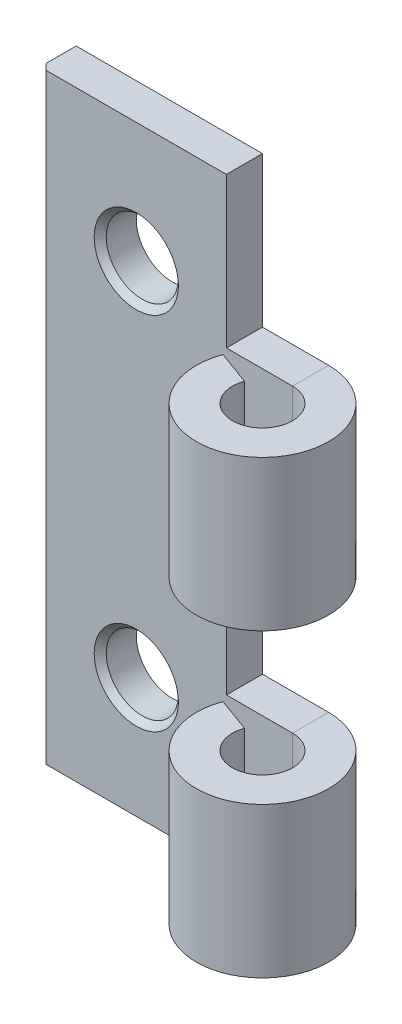
ISO-10303-21;
HEADER;
FILE_DESCRIPTION(('STEP AP214'),'2;1');
FILE_NAME('part.step','',(''),(''),'','','');
FILE_SCHEMA(('AUTOMOTIVE_DESIGN { 1 0 10303 214 1 1 1 1 }'));
ENDSEC;
DATA;
#1=APPLICATION_CONTEXT('core data for automotive mechanical design processes');
#2=APPLICATION_PROTOCOL_DEFINITION('international standard','automotive_design',2000,#1);
#3=PRODUCT_CONTEXT('',#1,'mechanical');
#4=PRODUCT('Part','Part','',(#3));
#5=PRODUCT_RELATED_PRODUCT_CATEGORY('part','',(#4));
#6=PRODUCT_DEFINITION_FORMATION('','',#4);
#7=PRODUCT_DEFINITION_CONTEXT('part definition',#1,'design');
#8=PRODUCT_DEFINITION('design','',#6,#7);
#9=PRODUCT_DEFINITION_SHAPE('','',#8);
#10=(LENGTH_UNIT() NAMED_UNIT(*) SI_UNIT(.MILLI.,.METRE.));
#11=(NAMED_UNIT(*) PLANE_ANGLE_UNIT() SI_UNIT($,.RADIAN.));
#12=(NAMED_UNIT(*) SI_UNIT($,.STERADIAN.) SOLID_ANGLE_UNIT());
#13=UNCERTAINTY_MEASURE_WITH_UNIT(LENGTH_MEASURE(1.E-05),#10,'distance_accuracy_value','');
#14=(GEOMETRIC_REPRESENTATION_CONTEXT(3) GLOBAL_UNCERTAINTY_ASSIGNED_CONTEXT((#13)) GLOBAL_UNIT_ASSIGNED_CONTEXT((#10,
#11,#12)) REPRESENTATION_CONTEXT('',''));
#15=CARTESIAN_POINT('',(0.,0.,0.));
#16=DIRECTION('',(0.,0.,1.));
#17=DIRECTION('',(1.,0.,0.));
#18=AXIS2_PLACEMENT_3D('',#15,#16,#17);
#19=CARTESIAN_POINT('',(-10.5,25.,3.));
#20=DIRECTION('',(0.,-1.,0.));
#21=DIRECTION('',(0.,0.,-1.));
#22=AXIS2_PLACEMENT_3D('',#19,#20,#21);
#23=PLANE('',#22);
#24=DIRECTION('',(0.,0.,-1.));
#25=VECTOR('',#24,1.);
#26=CARTESIAN_POINT('',(-10.5,25.,3.));
#27=LINE('',#26,#25);
#28=CARTESIAN_POINT('',(-10.5,25.,2.49999999999999));
#29=VERTEX_POINT('',#28);
#30=CARTESIAN_POINT('',(-10.5,25.,0.));
#31=VERTEX_POINT('',#30);
#32=EDGE_CURVE('E278',#29,#31,#27,.T.);
#33=ORIENTED_EDGE('',*,*,#32,.F.);
#34=DIRECTION('',(-0.707106781186548,0.,-0.707106781186548));
#35=VECTOR('',#34,1.);
#36=CARTESIAN_POINT('',(-9.99999999999999,25.,3.));
#37=LINE('',#36,#35);
#38=CARTESIAN_POINT('',(-9.99999999999999,25.,3.));
#39=VERTEX_POINT('',#38);
#40=EDGE_CURVE('E294',#29,#39,#37,.F.);
#41=ORIENTED_EDGE('',*,*,#40,.T.);
#42=DIRECTION('',(-1.,0.,0.));
#43=VECTOR('',#42,1.);
#44=CARTESIAN_POINT('',(-10.5,25.,3.));
#45=LINE('',#44,#43);
#46=CARTESIAN_POINT('',(5.,25.,3.));
#47=VERTEX_POINT('',#46);
#48=EDGE_CURVE('E260',#47,#39,#45,.T.);
#49=ORIENTED_EDGE('',*,*,#48,.F.);
#50=DIRECTION('',(0.,0.,1.));
#51=VECTOR('',#50,1.);
#52=CARTESIAN_POINT('',(5.,25.,0.));
#53=LINE('',#52,#51);
#54=CARTESIAN_POINT('',(5.,25.,0.));
#55=VERTEX_POINT('',#54);
#56=EDGE_CURVE('E157',#55,#47,#53,.T.);
#57=ORIENTED_EDGE('',*,*,#56,.F.);
#58=DIRECTION('',(-1.,0.,0.));
#59=VECTOR('',#58,1.);
#60=CARTESIAN_POINT('',(-10.5,25.,0.));
#61=LINE('',#60,#59);
#62=EDGE_CURVE('E172',#55,#31,#61,.T.);
#63=ORIENTED_EDGE('',*,*,#62,.T.);
#64=EDGE_LOOP('',(#33,#41,#49,#57,#63));
#65=FACE_BOUND('',#64,.T.);
#66=ADVANCED_FACE('F40',(#65),#23,.F.);
#67=CARTESIAN_POINT('',(-10.5,-25.,3.));
#68=DIRECTION('',(1.,0.,0.));
#69=DIRECTION('',(0.,0.,-1.));
#70=AXIS2_PLACEMENT_3D('',#67,#68,#69);
#71=PLANE('',#70);
#72=DIRECTION('',(0.,0.,-1.));
#73=VECTOR('',#72,1.);
#74=CARTESIAN_POINT('',(-10.5,-25.,3.));
#75=LINE('',#74,#73);
#76=CARTESIAN_POINT('',(-10.5,-25.,2.49999999999999));
#77=VERTEX_POINT('',#76);
#78=CARTESIAN_POINT('',(-10.5,-25.,0.));
#79=VERTEX_POINT('',#78);
#80=EDGE_CURVE('E276',#77,#79,#75,.T.);
#81=ORIENTED_EDGE('',*,*,#80,.F.);
#82=DIRECTION('',(0.,1.,0.));
#83=VECTOR('',#82,1.);
#84=CARTESIAN_POINT('',(-10.5,-25.,2.49999999999999));
#85=LINE('',#84,#83);
#86=EDGE_CURVE('E56',#77,#29,#85,.T.);
#87=ORIENTED_EDGE('',*,*,#86,.T.);
#88=ORIENTED_EDGE('',*,*,#32,.T.);
#89=DIRECTION('',(0.,-1.,0.));
#90=VECTOR('',#89,1.);
#91=CARTESIAN_POINT('',(-10.5,-25.,0.));
#92=LINE('',#91,#90);
#93=EDGE_CURVE('E270',#31,#79,#92,.T.);
#94=ORIENTED_EDGE('',*,*,#93,.T.);
#95=EDGE_LOOP('',(#81,#87,#88,#94));
#96=FACE_BOUND('',#95,.T.);
#97=ADVANCED_FACE('F316',(#96),#71,.F.);
#98=CARTESIAN_POINT('',(-10.5,-25.,3.));
#99=DIRECTION('',(0.,1.,0.));
#100=DIRECTION('',(0.,0.,1.));
#101=AXIS2_PLACEMENT_3D('',#98,#99,#100);
#102=PLANE('',#101);
#103=DIRECTION('',(1.,0.,0.));
#104=VECTOR('',#103,1.);
#105=CARTESIAN_POINT('',(-10.5,-25.,3.));
#106=LINE('',#105,#104);
#107=CARTESIAN_POINT('',(-9.99999999999999,-25.,3.));
#108=VERTEX_POINT('',#107);
#109=CARTESIAN_POINT('',(10.5,-25.,3.));
#110=VERTEX_POINT('',#109);
#111=EDGE_CURVE('E264',#108,#110,#106,.T.);
#112=ORIENTED_EDGE('',*,*,#111,.F.);
#113=DIRECTION('',(0.707106781186548,0.,0.707106781186548));
#114=VECTOR('',#113,1.);
#115=CARTESIAN_POINT('',(-9.99999999999999,-25.,3.));
#116=LINE('',#115,#114);
#117=EDGE_CURVE('E64',#108,#77,#116,.F.);
#118=ORIENTED_EDGE('',*,*,#117,.T.);
#119=ORIENTED_EDGE('',*,*,#80,.T.);
#120=DIRECTION('',(1.,0.,0.));
#121=VECTOR('',#120,1.);
#122=CARTESIAN_POINT('',(-10.5,-25.,0.));
#123=LINE('',#122,#121);
#124=CARTESIAN_POINT('',(10.5,-25.,0.));
#125=VERTEX_POINT('',#124);
#126=EDGE_CURVE('E261',#79,#125,#123,.T.);
#127=ORIENTED_EDGE('',*,*,#126,.T.);
#128=DIRECTION('',(0.,0.,-1.));
#129=VECTOR('',#128,1.);
#130=CARTESIAN_POINT('',(10.5,-25.,3.));
#131=LINE('',#130,#129);
#132=EDGE_CURVE('E266',#110,#125,#131,.T.);
#133=ORIENTED_EDGE('',*,*,#132,.F.);
#134=EDGE_LOOP('',(#112,#118,#119,#127,#133));
#135=FACE_BOUND('',#134,.T.);
#136=ADVANCED_FACE('F322',(#135),#102,.F.);
#137=CARTESIAN_POINT('',(0.,0.,3.));
#138=DIRECTION('',(0.,0.,-1.));
#139=DIRECTION('',(-1.,0.,0.));
#140=AXIS2_PLACEMENT_3D('',#137,#138,#139);
#141=PLANE('',#140);
#142=CARTESIAN_POINT('',(-2.5,-15.,3.));
#143=DIRECTION('',(0.,0.,-1.));
#144=DIRECTION('',(-1.,0.,0.));
#145=AXIS2_PLACEMENT_3D('',#142,#143,#144);
#146=CIRCLE('',#145,3.50000000000001);
#147=CARTESIAN_POINT('',(-6.00000000000001,-15.,3.));
#148=VERTEX_POINT('',#147);
#149=EDGE_CURVE('E286',#148,#148,#146,.T.);
#150=ORIENTED_EDGE('',*,*,#149,.T.);
#151=EDGE_LOOP('',(#150));
#152=FACE_BOUND('',#151,.T.);
#153=CARTESIAN_POINT('',(-2.5,15.,3.));
#154=DIRECTION('',(0.,0.,-1.));
#155=DIRECTION('',(-1.,0.,0.));
#156=AXIS2_PLACEMENT_3D('',#153,#154,#155);
#157=CIRCLE('',#156,3.50000000000001);
#158=CARTESIAN_POINT('',(-6.00000000000001,15.,3.));
#159=VERTEX_POINT('',#158);
#160=EDGE_CURVE('E280',#159,#159,#157,.T.);
#161=ORIENTED_EDGE('',*,*,#160,.T.);
#162=EDGE_LOOP('',(#161));
#163=FACE_BOUND('',#162,.T.);
#164=ORIENTED_EDGE('',*,*,#48,.T.);
#165=DIRECTION('',(0.,-1.,0.));
#166=VECTOR('',#165,1.);
#167=CARTESIAN_POINT('',(-9.99999999999999,0.,3.));
#168=LINE('',#167,#166);
#169=EDGE_CURVE('E289',#39,#108,#168,.T.);
#170=ORIENTED_EDGE('',*,*,#169,.T.);
#171=ORIENTED_EDGE('',*,*,#111,.T.);
#172=DIRECTION('',(0.,1.,0.));
#173=VECTOR('',#172,1.);
#174=CARTESIAN_POINT('',(10.5,-25.,3.));
#175=LINE('',#174,#173);
#176=CARTESIAN_POINT('',(10.5,-12.5,3.));
#177=VERTEX_POINT('',#176);
#178=EDGE_CURVE('E257',#110,#177,#175,.T.);
#179=ORIENTED_EDGE('',*,*,#178,.T.);
#180=DIRECTION('',(1.,0.,0.));
#181=VECTOR('',#180,1.);
#182=CARTESIAN_POINT('',(5.,-12.5,3.));
#183=LINE('',#182,#181);
#184=CARTESIAN_POINT('',(5.,-12.5,3.));
#185=VERTEX_POINT('',#184);
#186=EDGE_CURVE('E197',#185,#177,#183,.T.);
#187=ORIENTED_EDGE('',*,*,#186,.F.);
#188=DIRECTION('',(0.,-1.,0.));
#189=VECTOR('',#188,1.);
#190=CARTESIAN_POINT('',(5.,-12.5,3.));
#191=LINE('',#190,#189);
#192=CARTESIAN_POINT('',(5.,0.,3.));
#193=VERTEX_POINT('',#192);
#194=EDGE_CURVE('E194',#193,#185,#191,.T.);
#195=ORIENTED_EDGE('',*,*,#194,.F.);
#196=DIRECTION('',(-1.,0.,0.));
#197=VECTOR('',#196,1.);
#198=CARTESIAN_POINT('',(5.,0.,3.));
#199=LINE('',#198,#197);
#200=CARTESIAN_POINT('',(10.5,0.,3.));
#201=VERTEX_POINT('',#200);
#202=EDGE_CURVE('E187',#201,#193,#199,.T.);
#203=ORIENTED_EDGE('',*,*,#202,.F.);
#204=DIRECTION('',(0.,1.,0.));
#205=VECTOR('',#204,1.);
#206=CARTESIAN_POINT('',(10.5,12.5,3.));
#207=LINE('',#206,#205);
#208=CARTESIAN_POINT('',(10.5,12.5,3.));
#209=VERTEX_POINT('',#208);
#210=EDGE_CURVE('E216',#209,#201,#207,.F.);
#211=ORIENTED_EDGE('',*,*,#210,.F.);
#212=DIRECTION('',(1.,0.,0.));
#213=VECTOR('',#212,1.);
#214=CARTESIAN_POINT('',(5.,12.5,3.));
#215=LINE('',#214,#213);
#216=CARTESIAN_POINT('',(5.,12.5,3.));
#217=VERTEX_POINT('',#216);
#218=EDGE_CURVE('E173',#217,#209,#215,.T.);
#219=ORIENTED_EDGE('',*,*,#218,.F.);
#220=DIRECTION('',(0.,-1.,0.));
#221=VECTOR('',#220,1.);
#222=CARTESIAN_POINT('',(5.,12.5,3.));
#223=LINE('',#222,#221);
#224=EDGE_CURVE('E154',#47,#217,#223,.T.);
#225=ORIENTED_EDGE('',*,*,#224,.F.);
#226=EDGE_LOOP('',(#164,#170,#171,#179,#187,#195,#203,#211,#219,#225));
#227=FACE_BOUND('',#226,.T.);
#228=ADVANCED_FACE('F334',(#152,#163,#227),#141,.F.);
#229=CARTESIAN_POINT('',(0.,0.,0.));
#230=DIRECTION('',(0.,0.,-1.));
#231=DIRECTION('',(-1.,0.,0.));
#232=AXIS2_PLACEMENT_3D('',#229,#230,#231);
#233=PLANE('',#232);
#234=CARTESIAN_POINT('',(-2.5,15.,0.));
#235=DIRECTION('',(0.,0.,-1.));
#236=DIRECTION('',(-1.,0.,0.));
#237=AXIS2_PLACEMENT_3D('',#234,#235,#236);
#238=CIRCLE('',#237,3.);
#239=CARTESIAN_POINT('',(-5.5,15.,0.));
#240=VERTEX_POINT('',#239);
#241=EDGE_CURVE('E281',#240,#240,#238,.T.);
#242=ORIENTED_EDGE('',*,*,#241,.F.);
#243=EDGE_LOOP('',(#242));
#244=FACE_BOUND('',#243,.T.);
#245=CARTESIAN_POINT('',(-2.5,-15.,0.));
#246=DIRECTION('',(0.,0.,-1.));
#247=DIRECTION('',(-1.,0.,0.));
#248=AXIS2_PLACEMENT_3D('',#245,#246,#247);
#249=CIRCLE('',#248,3.);
#250=CARTESIAN_POINT('',(-5.5,-15.,0.));
#251=VERTEX_POINT('',#250);
#252=EDGE_CURVE('E177',#251,#251,#249,.T.);
#253=ORIENTED_EDGE('',*,*,#252,.F.);
#254=EDGE_LOOP('',(#253));
#255=FACE_BOUND('',#254,.T.);
#256=DIRECTION('',(0.,-1.,0.));
#257=VECTOR('',#256,1.);
#258=CARTESIAN_POINT('',(5.,12.5,0.));
#259=LINE('',#258,#257);
#260=CARTESIAN_POINT('',(5.,12.5,0.));
#261=VERTEX_POINT('',#260);
#262=EDGE_CURVE('E151',#55,#261,#259,.T.);
#263=ORIENTED_EDGE('',*,*,#262,.T.);
#264=DIRECTION('',(1.,0.,0.));
#265=VECTOR('',#264,1.);
#266=CARTESIAN_POINT('',(5.,12.5,0.));
#267=LINE('',#266,#265);
#268=CARTESIAN_POINT('',(10.5,12.5,0.));
#269=VERTEX_POINT('',#268);
#270=EDGE_CURVE('E158',#261,#269,#267,.T.);
#271=ORIENTED_EDGE('',*,*,#270,.T.);
#272=DIRECTION('',(0.,1.,0.));
#273=VECTOR('',#272,1.);
#274=CARTESIAN_POINT('',(10.5,12.5,0.));
#275=LINE('',#274,#273);
#276=CARTESIAN_POINT('',(10.5,0.,0.));
#277=VERTEX_POINT('',#276);
#278=EDGE_CURVE('E203',#269,#277,#275,.F.);
#279=ORIENTED_EDGE('',*,*,#278,.T.);
#280=DIRECTION('',(-1.,0.,0.));
#281=VECTOR('',#280,1.);
#282=CARTESIAN_POINT('',(5.,0.,0.));
#283=LINE('',#282,#281);
#284=CARTESIAN_POINT('',(5.,0.,0.));
#285=VERTEX_POINT('',#284);
#286=EDGE_CURVE('E190',#277,#285,#283,.T.);
#287=ORIENTED_EDGE('',*,*,#286,.T.);
#288=DIRECTION('',(0.,-1.,0.));
#289=VECTOR('',#288,1.);
#290=CARTESIAN_POINT('',(5.,-12.5,0.));
#291=LINE('',#290,#289);
#292=CARTESIAN_POINT('',(5.,-12.5,0.));
#293=VERTEX_POINT('',#292);
#294=EDGE_CURVE('E183',#285,#293,#291,.T.);
#295=ORIENTED_EDGE('',*,*,#294,.T.);
#296=DIRECTION('',(1.,0.,0.));
#297=VECTOR('',#296,1.);
#298=CARTESIAN_POINT('',(5.,-12.5,0.));
#299=LINE('',#298,#297);
#300=CARTESIAN_POINT('',(10.5,-12.5,0.));
#301=VERTEX_POINT('',#300);
#302=EDGE_CURVE('E186',#293,#301,#299,.T.);
#303=ORIENTED_EDGE('',*,*,#302,.T.);
#304=DIRECTION('',(0.,1.,0.));
#305=VECTOR('',#304,1.);
#306=CARTESIAN_POINT('',(10.5,-25.,0.));
#307=LINE('',#306,#305);
#308=EDGE_CURVE('E255',#125,#301,#307,.T.);
#309=ORIENTED_EDGE('',*,*,#308,.F.);
#310=ORIENTED_EDGE('',*,*,#126,.F.);
#311=ORIENTED_EDGE('',*,*,#93,.F.);
#312=ORIENTED_EDGE('',*,*,#62,.F.);
#313=EDGE_LOOP('',(#263,#271,#279,#287,#295,#303,#309,#310,#311,#312));
#314=FACE_BOUND('',#313,.T.);
#315=ADVANCED_FACE('F169',(#244,#255,#314),#233,.T.);
#316=CARTESIAN_POINT('',(8.15076844803524,-18.75,4.6449496416858));
#317=DIRECTION('',(-0.342020143325679,0.,0.939692620785905));
#318=DIRECTION('',(0.,1.,0.));
#319=AXIS2_PLACEMENT_3D('',#316,#317,#318);
#320=PLANE('',#319);
#321=DIRECTION('',(-0.939692620785905,0.,-0.342020143325679));
#322=VECTOR('',#321,1.);
#323=CARTESIAN_POINT('',(8.15076844803524,-12.5,4.6449496416858));
#324=LINE('',#323,#322);
#325=CARTESIAN_POINT('',(8.15076844803524,-12.5,4.6449496416858));
#326=VERTEX_POINT('',#325);
#327=CARTESIAN_POINT('',(5.33169058567752,-12.5,3.61888921170877));
#328=VERTEX_POINT('',#327);
#329=EDGE_CURVE('E253',#326,#328,#324,.T.);
#330=ORIENTED_EDGE('',*,*,#329,.F.);
#331=DIRECTION('',(0.,1.,0.));
#332=VECTOR('',#331,1.);
#333=CARTESIAN_POINT('',(8.15076844803524,-12.5,4.6449496416858));
#334=LINE('',#333,#332);
#335=CARTESIAN_POINT('',(8.15076844803524,-25.,4.6449496416858));
#336=VERTEX_POINT('',#335);
#337=EDGE_CURVE('E231',#336,#326,#334,.T.);
#338=ORIENTED_EDGE('',*,*,#337,.F.);
#339=DIRECTION('',(-0.939692620785905,0.,-0.342020143325679));
#340=VECTOR('',#339,1.);
#341=CARTESIAN_POINT('',(8.15076844803524,-25.,4.6449496416858));
#342=LINE('',#341,#340);
#343=CARTESIAN_POINT('',(5.33169058567752,-25.,3.61888921170877));
#344=VERTEX_POINT('',#343);
#345=EDGE_CURVE('E251',#336,#344,#342,.T.);
#346=ORIENTED_EDGE('',*,*,#345,.T.);
#347=DIRECTION('',(0.,1.,0.));
#348=VECTOR('',#347,1.);
#349=CARTESIAN_POINT('',(5.33169058567752,-12.5,3.61888921170877));
#350=LINE('',#349,#348);
#351=EDGE_CURVE('E238',#344,#328,#350,.T.);
#352=ORIENTED_EDGE('',*,*,#351,.T.);
#353=EDGE_LOOP('',(#330,#338,#346,#352));
#354=FACE_BOUND('',#353,.T.);
#355=ADVANCED_FACE('F337',(#354),#320,.F.);
#356=CARTESIAN_POINT('',(10.5,-25.,5.5));
#357=DIRECTION('',(0.,-1.,0.));
#358=DIRECTION('',(0.,0.,-1.));
#359=AXIS2_PLACEMENT_3D('',#356,#357,#358);
#360=PLANE('',#359);
#361=ORIENTED_EDGE('',*,*,#345,.F.);
#362=CARTESIAN_POINT('',(10.5,-25.,5.5));
#363=DIRECTION('',(0.,1.,0.));
#364=DIRECTION('',(0.,0.,1.));
#365=AXIS2_PLACEMENT_3D('',#362,#363,#364);
#366=CIRCLE('',#365,2.5);
#367=EDGE_CURVE('E241',#110,#336,#366,.F.);
#368=ORIENTED_EDGE('',*,*,#367,.F.);
#369=ORIENTED_EDGE('',*,*,#132,.T.);
#370=CARTESIAN_POINT('',(10.5,-25.,5.5));
#371=DIRECTION('',(0.,1.,0.));
#372=DIRECTION('',(0.,0.,1.));
#373=AXIS2_PLACEMENT_3D('',#370,#371,#372);
#374=CIRCLE('',#373,5.5);
#375=EDGE_CURVE('E233',#125,#344,#374,.F.);
#376=ORIENTED_EDGE('',*,*,#375,.T.);
#377=EDGE_LOOP('',(#361,#368,#369,#376));
#378=FACE_BOUND('',#377,.T.);
#379=ADVANCED_FACE('F346',(#378),#360,.T.);
#380=CARTESIAN_POINT('',(10.5,-12.5,5.5));
#381=DIRECTION('',(0.,-1.,0.));
#382=DIRECTION('',(0.,0.,-1.));
#383=AXIS2_PLACEMENT_3D('',#380,#381,#382);
#384=PLANE('',#383);
#385=CARTESIAN_POINT('',(10.5,-12.5,5.5));
#386=DIRECTION('',(0.,1.,0.));
#387=DIRECTION('',(0.,0.,1.));
#388=AXIS2_PLACEMENT_3D('',#385,#386,#387);
#389=CIRCLE('',#388,2.5);
#390=EDGE_CURVE('E246',#326,#177,#389,.T.);
#391=ORIENTED_EDGE('',*,*,#390,.F.);
#392=ORIENTED_EDGE('',*,*,#329,.T.);
#393=CARTESIAN_POINT('',(10.5,-12.5,5.5));
#394=DIRECTION('',(0.,1.,0.));
#395=DIRECTION('',(0.,0.,1.));
#396=AXIS2_PLACEMENT_3D('',#393,#394,#395);
#397=CIRCLE('',#396,5.5);
#398=EDGE_CURVE('E237',#328,#301,#397,.T.);
#399=ORIENTED_EDGE('',*,*,#398,.T.);
#400=DIRECTION('',(0.,0.,-1.));
#401=VECTOR('',#400,1.);
#402=CARTESIAN_POINT('',(10.5,-12.5,3.));
#403=LINE('',#402,#401);
#404=EDGE_CURVE('E236',#177,#301,#403,.T.);
#405=ORIENTED_EDGE('',*,*,#404,.F.);
#406=EDGE_LOOP('',(#391,#392,#399,#405));
#407=FACE_BOUND('',#406,.T.);
#408=ADVANCED_FACE('F342',(#407),#384,.F.);
#409=CARTESIAN_POINT('',(10.5,-12.5,5.5));
#410=DIRECTION('',(0.,1.,0.));
#411=DIRECTION('',(-0.939692620785905,0.,-0.342020143325679));
#412=AXIS2_PLACEMENT_3D('',#409,#410,#411);
#413=CYLINDRICAL_SURFACE('',#412,5.5);
#414=ORIENTED_EDGE('',*,*,#308,.T.);
#415=ORIENTED_EDGE('',*,*,#398,.F.);
#416=ORIENTED_EDGE('',*,*,#351,.F.);
#417=ORIENTED_EDGE('',*,*,#375,.F.);
#418=EDGE_LOOP('',(#414,#415,#416,#417));
#419=FACE_BOUND('',#418,.T.);
#420=ADVANCED_FACE('F345',(#419),#413,.T.);
#421=CARTESIAN_POINT('',(10.5,-12.5,5.5));
#422=DIRECTION('',(0.,1.,0.));
#423=DIRECTION('',(-0.939692620785905,0.,-0.342020143325679));
#424=AXIS2_PLACEMENT_3D('',#421,#422,#423);
#425=CYLINDRICAL_SURFACE('',#424,2.5);
#426=ORIENTED_EDGE('',*,*,#178,.F.);
#427=ORIENTED_EDGE('',*,*,#367,.T.);
#428=ORIENTED_EDGE('',*,*,#337,.T.);
#429=ORIENTED_EDGE('',*,*,#390,.T.);
#430=EDGE_LOOP('',(#426,#427,#428,#429));
#431=FACE_BOUND('',#430,.T.);
#432=ADVANCED_FACE('F354',(#431),#425,.F.);
#433=CARTESIAN_POINT('',(8.15076844803524,6.25,4.6449496416858));
#434=DIRECTION('',(-0.342020143325679,0.,0.939692620785905));
#435=DIRECTION('',(0.,1.,0.));
#436=AXIS2_PLACEMENT_3D('',#433,#434,#435);
#437=PLANE('',#436);
#438=DIRECTION('',(-0.939692620785905,0.,-0.342020143325679));
#439=VECTOR('',#438,1.);
#440=CARTESIAN_POINT('',(8.15076844803524,12.5,4.6449496416858));
#441=LINE('',#440,#439);
#442=CARTESIAN_POINT('',(8.15076844803524,12.5,4.6449496416858));
#443=VERTEX_POINT('',#442);
#444=CARTESIAN_POINT('',(5.33169058567752,12.5,3.61888921170877));
#445=VERTEX_POINT('',#444);
#446=EDGE_CURVE('E229',#443,#445,#441,.T.);
#447=ORIENTED_EDGE('',*,*,#446,.F.);
#448=DIRECTION('',(0.,1.,0.));
#449=VECTOR('',#448,1.);
#450=CARTESIAN_POINT('',(8.15076844803524,12.5,4.6449496416858));
#451=LINE('',#450,#449);
#452=CARTESIAN_POINT('',(8.15076844803524,0.,4.6449496416858));
#453=VERTEX_POINT('',#452);
#454=EDGE_CURVE('E181',#453,#443,#451,.T.);
#455=ORIENTED_EDGE('',*,*,#454,.F.);
#456=DIRECTION('',(-0.939692620785905,0.,-0.342020143325679));
#457=VECTOR('',#456,1.);
#458=CARTESIAN_POINT('',(8.15076844803524,0.,4.6449496416858));
#459=LINE('',#458,#457);
#460=CARTESIAN_POINT('',(5.33169058567752,0.,3.61888921170877));
#461=VERTEX_POINT('',#460);
#462=EDGE_CURVE('E227',#453,#461,#459,.T.);
#463=ORIENTED_EDGE('',*,*,#462,.T.);
#464=DIRECTION('',(0.,1.,0.));
#465=VECTOR('',#464,1.);
#466=CARTESIAN_POINT('',(5.33169058567752,12.5,3.61888921170877));
#467=LINE('',#466,#465);
#468=EDGE_CURVE('E209',#461,#445,#467,.T.);
#469=ORIENTED_EDGE('',*,*,#468,.T.);
#470=EDGE_LOOP('',(#447,#455,#463,#469));
#471=FACE_BOUND('',#470,.T.);
#472=ADVANCED_FACE('F357',(#471),#437,.F.);
#473=CARTESIAN_POINT('',(10.5,0.,5.5));
#474=DIRECTION('',(0.,-1.,0.));
#475=DIRECTION('',(0.,0.,-1.));
#476=AXIS2_PLACEMENT_3D('',#473,#474,#475);
#477=PLANE('',#476);
#478=ORIENTED_EDGE('',*,*,#462,.F.);
#479=CARTESIAN_POINT('',(10.5,0.,5.5));
#480=DIRECTION('',(0.,1.,0.));
#481=DIRECTION('',(0.,0.,1.));
#482=AXIS2_PLACEMENT_3D('',#479,#480,#481);
#483=CIRCLE('',#482,2.5);
#484=EDGE_CURVE('E212',#201,#453,#483,.F.);
#485=ORIENTED_EDGE('',*,*,#484,.F.);
#486=DIRECTION('',(0.,0.,-1.));
#487=VECTOR('',#486,1.);
#488=CARTESIAN_POINT('',(10.5,0.,3.));
#489=LINE('',#488,#487);
#490=EDGE_CURVE('E224',#201,#277,#489,.T.);
#491=ORIENTED_EDGE('',*,*,#490,.T.);
#492=CARTESIAN_POINT('',(10.5,0.,5.5));
#493=DIRECTION('',(0.,1.,0.));
#494=DIRECTION('',(0.,0.,1.));
#495=AXIS2_PLACEMENT_3D('',#492,#493,#494);
#496=CIRCLE('',#495,5.5);
#497=EDGE_CURVE('E205',#277,#461,#496,.F.);
#498=ORIENTED_EDGE('',*,*,#497,.T.);
#499=EDGE_LOOP('',(#478,#485,#491,#498));
#500=FACE_BOUND('',#499,.T.);
#501=ADVANCED_FACE('F366',(#500),#477,.T.);
#502=CARTESIAN_POINT('',(10.5,12.5,5.5));
#503=DIRECTION('',(0.,-1.,0.));
#504=DIRECTION('',(0.,0.,-1.));
#505=AXIS2_PLACEMENT_3D('',#502,#503,#504);
#506=PLANE('',#505);
#507=CARTESIAN_POINT('',(10.5,12.5,5.5));
#508=DIRECTION('',(0.,1.,0.));
#509=DIRECTION('',(0.,0.,1.));
#510=AXIS2_PLACEMENT_3D('',#507,#508,#509);
#511=CIRCLE('',#510,2.5);
#512=EDGE_CURVE('E219',#443,#209,#511,.T.);
#513=ORIENTED_EDGE('',*,*,#512,.F.);
#514=ORIENTED_EDGE('',*,*,#446,.T.);
#515=CARTESIAN_POINT('',(10.5,12.5,5.5));
#516=DIRECTION('',(0.,1.,0.));
#517=DIRECTION('',(0.,0.,1.));
#518=AXIS2_PLACEMENT_3D('',#515,#516,#517);
#519=CIRCLE('',#518,5.5);
#520=EDGE_CURVE('E206',#445,#269,#519,.T.);
#521=ORIENTED_EDGE('',*,*,#520,.T.);
#522=DIRECTION('',(0.,0.,-1.));
#523=VECTOR('',#522,1.);
#524=CARTESIAN_POINT('',(10.5,12.5,3.));
#525=LINE('',#524,#523);
#526=EDGE_CURVE('E163',#209,#269,#525,.T.);
#527=ORIENTED_EDGE('',*,*,#526,.F.);
#528=EDGE_LOOP('',(#513,#514,#521,#527));
#529=FACE_BOUND('',#528,.T.);
#530=ADVANCED_FACE('F362',(#529),#506,.F.);
#531=CARTESIAN_POINT('',(10.5,12.5,5.5));
#532=DIRECTION('',(0.,1.,0.));
#533=DIRECTION('',(-0.939692620785905,0.,-0.342020143325679));
#534=AXIS2_PLACEMENT_3D('',#531,#532,#533);
#535=CYLINDRICAL_SURFACE('',#534,5.5);
#536=ORIENTED_EDGE('',*,*,#278,.F.);
#537=ORIENTED_EDGE('',*,*,#520,.F.);
#538=ORIENTED_EDGE('',*,*,#468,.F.);
#539=ORIENTED_EDGE('',*,*,#497,.F.);
#540=EDGE_LOOP('',(#536,#537,#538,#539));
#541=FACE_BOUND('',#540,.T.);
#542=ADVANCED_FACE('F365',(#541),#535,.T.);
#543=CARTESIAN_POINT('',(10.5,12.5,5.5));
#544=DIRECTION('',(0.,1.,0.));
#545=DIRECTION('',(-0.939692620785905,0.,-0.342020143325679));
#546=AXIS2_PLACEMENT_3D('',#543,#544,#545);
#547=CYLINDRICAL_SURFACE('',#546,2.5);
#548=ORIENTED_EDGE('',*,*,#210,.T.);
#549=ORIENTED_EDGE('',*,*,#484,.T.);
#550=ORIENTED_EDGE('',*,*,#454,.T.);
#551=ORIENTED_EDGE('',*,*,#512,.T.);
#552=EDGE_LOOP('',(#548,#549,#550,#551));
#553=FACE_BOUND('',#552,.T.);
#554=ADVANCED_FACE('F374',(#553),#547,.F.);
#555=CARTESIAN_POINT('',(5.,12.5,0.));
#556=DIRECTION('',(-1.,0.,0.));
#557=DIRECTION('',(0.,0.,1.));
#558=AXIS2_PLACEMENT_3D('',#555,#556,#557);
#559=PLANE('',#558);
#560=ORIENTED_EDGE('',*,*,#224,.T.);
#561=DIRECTION('',(0.,0.,1.));
#562=VECTOR('',#561,1.);
#563=CARTESIAN_POINT('',(5.,12.5,0.));
#564=LINE('',#563,#562);
#565=EDGE_CURVE('E147',#261,#217,#564,.T.);
#566=ORIENTED_EDGE('',*,*,#565,.F.);
#567=ORIENTED_EDGE('',*,*,#262,.F.);
#568=ORIENTED_EDGE('',*,*,#56,.T.);
#569=EDGE_LOOP('',(#560,#566,#567,#568));
#570=FACE_BOUND('',#569,.T.);
#571=ADVANCED_FACE('F149',(#570),#559,.F.);
#572=CARTESIAN_POINT('',(5.,12.5,0.));
#573=DIRECTION('',(0.,-1.,0.));
#574=DIRECTION('',(0.,0.,-1.));
#575=AXIS2_PLACEMENT_3D('',#572,#573,#574);
#576=PLANE('',#575);
#577=ORIENTED_EDGE('',*,*,#218,.T.);
#578=ORIENTED_EDGE('',*,*,#526,.T.);
#579=ORIENTED_EDGE('',*,*,#270,.F.);
#580=ORIENTED_EDGE('',*,*,#565,.T.);
#581=EDGE_LOOP('',(#577,#578,#579,#580));
#582=FACE_BOUND('',#581,.T.);
#583=ADVANCED_FACE('F161',(#582),#576,.F.);
#584=CARTESIAN_POINT('',(5.,-12.5,0.));
#585=DIRECTION('',(-1.,0.,0.));
#586=DIRECTION('',(0.,0.,1.));
#587=AXIS2_PLACEMENT_3D('',#584,#585,#586);
#588=PLANE('',#587);
#589=ORIENTED_EDGE('',*,*,#194,.T.);
#590=DIRECTION('',(0.,0.,1.));
#591=VECTOR('',#590,1.);
#592=CARTESIAN_POINT('',(5.,-12.5,0.));
#593=LINE('',#592,#591);
#594=EDGE_CURVE('E193',#293,#185,#593,.T.);
#595=ORIENTED_EDGE('',*,*,#594,.F.);
#596=ORIENTED_EDGE('',*,*,#294,.F.);
#597=DIRECTION('',(0.,0.,1.));
#598=VECTOR('',#597,1.);
#599=CARTESIAN_POINT('',(5.,0.,0.));
#600=LINE('',#599,#598);
#601=EDGE_CURVE('E179',#285,#193,#600,.T.);
#602=ORIENTED_EDGE('',*,*,#601,.T.);
#603=EDGE_LOOP('',(#589,#595,#596,#602));
#604=FACE_BOUND('',#603,.T.);
#605=ADVANCED_FACE('F381',(#604),#588,.F.);
#606=CARTESIAN_POINT('',(5.,0.,0.));
#607=DIRECTION('',(0.,1.,0.));
#608=DIRECTION('',(0.,0.,1.));
#609=AXIS2_PLACEMENT_3D('',#606,#607,#608);
#610=PLANE('',#609);
#611=ORIENTED_EDGE('',*,*,#202,.T.);
#612=ORIENTED_EDGE('',*,*,#601,.F.);
#613=ORIENTED_EDGE('',*,*,#286,.F.);
#614=ORIENTED_EDGE('',*,*,#490,.F.);
#615=EDGE_LOOP('',(#611,#612,#613,#614));
#616=FACE_BOUND('',#615,.T.);
#617=ADVANCED_FACE('F384',(#616),#610,.F.);
#618=CARTESIAN_POINT('',(5.,-12.5,0.));
#619=DIRECTION('',(0.,-1.,0.));
#620=DIRECTION('',(0.,0.,-1.));
#621=AXIS2_PLACEMENT_3D('',#618,#619,#620);
#622=PLANE('',#621);
#623=ORIENTED_EDGE('',*,*,#186,.T.);
#624=ORIENTED_EDGE('',*,*,#404,.T.);
#625=ORIENTED_EDGE('',*,*,#302,.F.);
#626=ORIENTED_EDGE('',*,*,#594,.T.);
#627=EDGE_LOOP('',(#623,#624,#625,#626));
#628=FACE_BOUND('',#627,.T.);
#629=ADVANCED_FACE('F386',(#628),#622,.F.);
#630=CARTESIAN_POINT('',(-2.5,-15.,3.));
#631=DIRECTION('',(0.,0.,1.));
#632=DIRECTION('',(1.,0.,0.));
#633=AXIS2_PLACEMENT_3D('',#630,#631,#632);
#634=CYLINDRICAL_SURFACE('',#633,3.);
#635=CARTESIAN_POINT('',(-2.5,-15.,2.49999999999999));
#636=DIRECTION('',(0.,0.,-1.));
#637=DIRECTION('',(-1.,0.,0.));
#638=AXIS2_PLACEMENT_3D('',#635,#636,#637);
#639=CIRCLE('',#638,3.);
#640=CARTESIAN_POINT('',(-5.5,-15.,2.49999999999999));
#641=VERTEX_POINT('',#640);
#642=EDGE_CURVE('E49',#641,#641,#639,.F.);
#643=ORIENTED_EDGE('',*,*,#642,.T.);
#644=EDGE_LOOP('',(#643));
#645=FACE_BOUND('',#644,.T.);
#646=ORIENTED_EDGE('',*,*,#252,.T.);
#647=EDGE_LOOP('',(#646));
#648=FACE_BOUND('',#647,.T.);
#649=ADVANCED_FACE('F298',(#645,#648),#634,.F.);
#650=CARTESIAN_POINT('',(-2.5,15.,3.));
#651=DIRECTION('',(0.,0.,1.));
#652=DIRECTION('',(1.,0.,0.));
#653=AXIS2_PLACEMENT_3D('',#650,#651,#652);
#654=CYLINDRICAL_SURFACE('',#653,3.);
#655=CARTESIAN_POINT('',(-2.5,15.,2.49999999999999));
#656=DIRECTION('',(0.,0.,-1.));
#657=DIRECTION('',(-1.,0.,0.));
#658=AXIS2_PLACEMENT_3D('',#655,#656,#657);
#659=CIRCLE('',#658,3.);
#660=CARTESIAN_POINT('',(-5.5,15.,2.49999999999999));
#661=VERTEX_POINT('',#660);
#662=EDGE_CURVE('E11',#661,#661,#659,.F.);
#663=ORIENTED_EDGE('',*,*,#662,.T.);
#664=EDGE_LOOP('',(#663));
#665=FACE_BOUND('',#664,.T.);
#666=ORIENTED_EDGE('',*,*,#241,.T.);
#667=EDGE_LOOP('',(#666));
#668=FACE_BOUND('',#667,.T.);
#669=ADVANCED_FACE('F310',(#665,#668),#654,.F.);
#670=CARTESIAN_POINT('',(-9.99999999999999,0.,3.));
#671=DIRECTION('',(0.707106781186548,0.,-0.707106781186548));
#672=DIRECTION('',(0.,-1.,0.));
#673=AXIS2_PLACEMENT_3D('',#670,#671,#672);
#674=PLANE('',#673);
#675=ORIENTED_EDGE('',*,*,#40,.F.);
#676=ORIENTED_EDGE('',*,*,#86,.F.);
#677=ORIENTED_EDGE('',*,*,#117,.F.);
#678=ORIENTED_EDGE('',*,*,#169,.F.);
#679=EDGE_LOOP('',(#675,#676,#677,#678));
#680=FACE_BOUND('',#679,.T.);
#681=ADVANCED_FACE('F303',(#680),#674,.F.);
#682=CARTESIAN_POINT('',(-2.5,-15.,2.49999999999999));
#683=DIRECTION('',(0.,0.,1.));
#684=DIRECTION('',(1.,0.,0.));
#685=AXIS2_PLACEMENT_3D('',#682,#683,#684);
#686=CONICAL_SURFACE('',#685,3.,0.785398163397452);
#687=ORIENTED_EDGE('',*,*,#149,.F.);
#688=EDGE_LOOP('',(#687));
#689=FACE_BOUND('',#688,.T.);
#690=ORIENTED_EDGE('',*,*,#642,.F.);
#691=EDGE_LOOP('',(#690));
#692=FACE_BOUND('',#691,.T.);
#693=ADVANCED_FACE('F301',(#689,#692),#686,.F.);
#694=CARTESIAN_POINT('',(-2.5,15.,2.49999999999999));
#695=DIRECTION('',(0.,0.,1.));
#696=DIRECTION('',(1.,0.,0.));
#697=AXIS2_PLACEMENT_3D('',#694,#695,#696);
#698=CONICAL_SURFACE('',#697,3.,0.785398163397452);
#699=ORIENTED_EDGE('',*,*,#160,.F.);
#700=EDGE_LOOP('',(#699));
#701=FACE_BOUND('',#700,.T.);
#702=ORIENTED_EDGE('',*,*,#662,.F.);
#703=EDGE_LOOP('',(#702));
#704=FACE_BOUND('',#703,.T.);
#705=ADVANCED_FACE('F43',(#701,#704),#698,.F.);
#706=CLOSED_SHELL('',(#66,#97,#136,#228,#315,#355,#379,#408,#420,#432,#472,#501,#530,#542,#554,
#571,#583,#605,#617,#629,#649,#669,#681,#693,#705));
#707=MANIFOLD_SOLID_BREP('B2',#706);
#708=ADVANCED_BREP_SHAPE_REPRESENTATION('',(#18,#707),#14);
#709=SHAPE_DEFINITION_REPRESENTATION(#9,#708);
ENDSEC;
END-ISO-10303-21;
